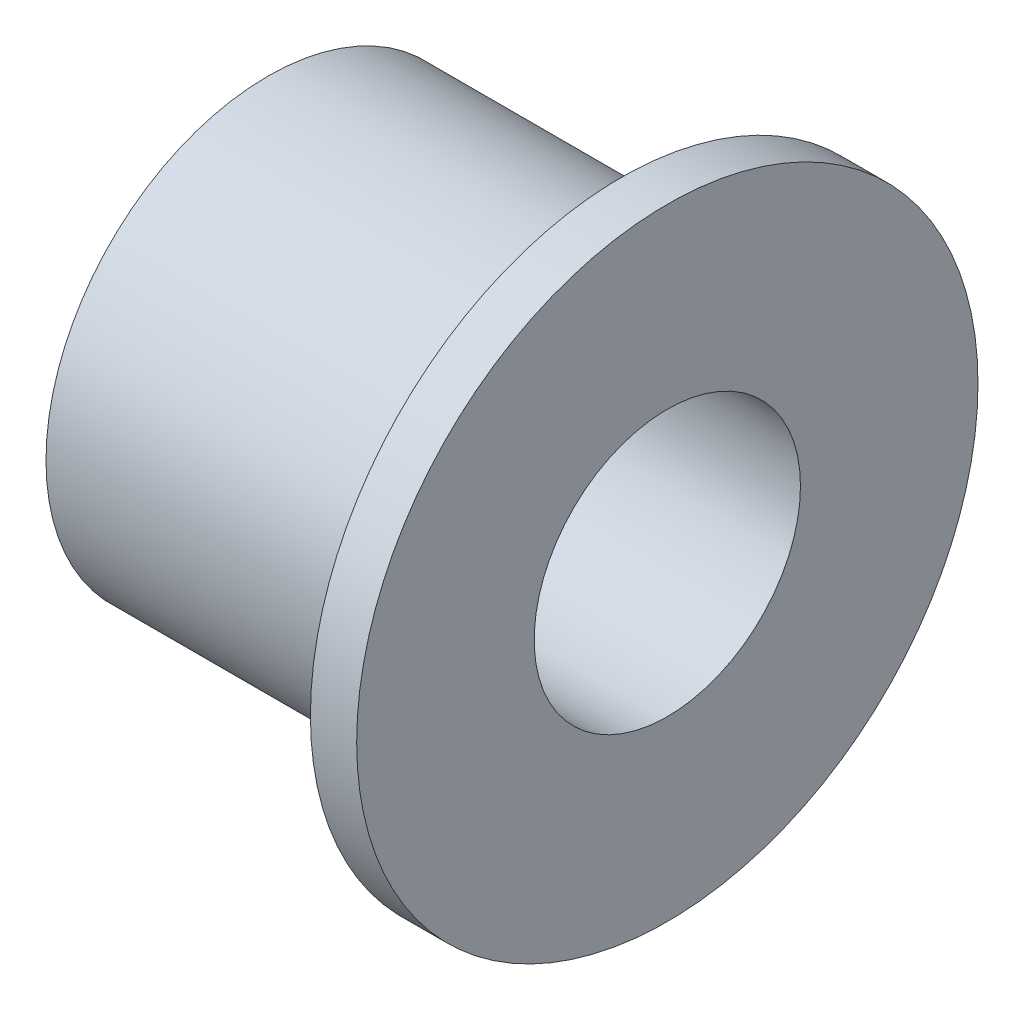
ISO-10303-21;
HEADER;
FILE_DESCRIPTION(('STEP AP214'),'2;1');
FILE_NAME('part.step','',(''),(''),'','','');
FILE_SCHEMA(('AUTOMOTIVE_DESIGN { 1 0 10303 214 1 1 1 1 }'));
ENDSEC;
DATA;
#1=APPLICATION_CONTEXT('core data for automotive mechanical design processes');
#2=APPLICATION_PROTOCOL_DEFINITION('international standard','automotive_design',2000,#1);
#3=PRODUCT_CONTEXT('',#1,'mechanical');
#4=PRODUCT('Part','Part','',(#3));
#5=PRODUCT_RELATED_PRODUCT_CATEGORY('part','',(#4));
#6=PRODUCT_DEFINITION_FORMATION('','',#4);
#7=PRODUCT_DEFINITION_CONTEXT('part definition',#1,'design');
#8=PRODUCT_DEFINITION('design','',#6,#7);
#9=PRODUCT_DEFINITION_SHAPE('','',#8);
#10=(LENGTH_UNIT() NAMED_UNIT(*) SI_UNIT(.MILLI.,.METRE.));
#11=(NAMED_UNIT(*) PLANE_ANGLE_UNIT() SI_UNIT($,.RADIAN.));
#12=(NAMED_UNIT(*) SI_UNIT($,.STERADIAN.) SOLID_ANGLE_UNIT());
#13=UNCERTAINTY_MEASURE_WITH_UNIT(LENGTH_MEASURE(1.E-05),#10,'distance_accuracy_value','');
#14=(GEOMETRIC_REPRESENTATION_CONTEXT(3) GLOBAL_UNCERTAINTY_ASSIGNED_CONTEXT((#13)) GLOBAL_UNIT_ASSIGNED_CONTEXT((#10,
#11,#12)) REPRESENTATION_CONTEXT('',''));
#15=CARTESIAN_POINT('',(0.,0.,0.));
#16=DIRECTION('',(0.,0.,1.));
#17=DIRECTION('',(1.,0.,0.));
#18=AXIS2_PLACEMENT_3D('',#15,#16,#17);
#19=CARTESIAN_POINT('',(12.7,0.,0.));
#20=DIRECTION('',(-1.,0.,0.));
#21=DIRECTION('',(0.,0.,1.));
#22=AXIS2_PLACEMENT_3D('',#19,#20,#21);
#23=CYLINDRICAL_SURFACE('',#22,7.9375);
#24=CARTESIAN_POINT('',(0.,0.,0.));
#25=DIRECTION('',(1.,0.,0.));
#26=DIRECTION('',(0.,0.,-1.));
#27=AXIS2_PLACEMENT_3D('',#24,#25,#26);
#28=CIRCLE('',#27,7.9375);
#29=CARTESIAN_POINT('',(0.,0.,-7.9375));
#30=VERTEX_POINT('',#29);
#31=EDGE_CURVE('E34',#30,#30,#28,.T.);
#32=ORIENTED_EDGE('',*,*,#31,.T.);
#33=EDGE_LOOP('',(#32));
#34=FACE_BOUND('',#33,.T.);
#35=CARTESIAN_POINT('',(12.6327746792743,0.,0.));
#36=DIRECTION('',(1.,0.,0.));
#37=DIRECTION('',(0.,0.,-1.));
#38=AXIS2_PLACEMENT_3D('',#35,#36,#37);
#39=CIRCLE('',#38,7.9375);
#40=CARTESIAN_POINT('',(12.6327746792743,0.,-7.9375));
#41=VERTEX_POINT('',#40);
#42=EDGE_CURVE('E10',#41,#41,#39,.T.);
#43=ORIENTED_EDGE('',*,*,#42,.F.);
#44=EDGE_LOOP('',(#43));
#45=FACE_BOUND('',#44,.T.);
#46=ADVANCED_FACE('F31',(#34,#45),#23,.T.);
#47=CARTESIAN_POINT('',(0.,0.,0.));
#48=DIRECTION('',(1.,0.,0.));
#49=DIRECTION('',(0.,0.,-1.));
#50=AXIS2_PLACEMENT_3D('',#47,#48,#49);
#51=PLANE('',#50);
#52=ORIENTED_EDGE('',*,*,#31,.F.);
#53=EDGE_LOOP('',(#52));
#54=FACE_BOUND('',#53,.T.);
#55=CARTESIAN_POINT('',(0.,0.,0.));
#56=DIRECTION('',(1.,0.,0.));
#57=DIRECTION('',(0.,0.,-1.));
#58=AXIS2_PLACEMENT_3D('',#55,#56,#57);
#59=CIRCLE('',#58,4.7625);
#60=CARTESIAN_POINT('',(0.,0.,-4.7625));
#61=VERTEX_POINT('',#60);
#62=EDGE_CURVE('E42',#61,#61,#59,.T.);
#63=ORIENTED_EDGE('',*,*,#62,.T.);
#64=EDGE_LOOP('',(#63));
#65=FACE_BOUND('',#64,.T.);
#66=ADVANCED_FACE('F74',(#54,#65),#51,.F.);
#67=CARTESIAN_POINT('',(12.7,0.,0.));
#68=DIRECTION('',(-1.,0.,0.));
#69=DIRECTION('',(0.,0.,1.));
#70=AXIS2_PLACEMENT_3D('',#67,#68,#69);
#71=CYLINDRICAL_SURFACE('',#70,4.7625);
#72=ORIENTED_EDGE('',*,*,#62,.F.);
#73=EDGE_LOOP('',(#72));
#74=FACE_BOUND('',#73,.T.);
#75=CARTESIAN_POINT('',(14.2875,0.,0.));
#76=DIRECTION('',(1.,0.,0.));
#77=DIRECTION('',(0.,0.,-1.));
#78=AXIS2_PLACEMENT_3D('',#75,#76,#77);
#79=CIRCLE('',#78,4.7625);
#80=CARTESIAN_POINT('',(14.2875,0.,-4.7625));
#81=VERTEX_POINT('',#80);
#82=EDGE_CURVE('E54',#81,#81,#79,.T.);
#83=ORIENTED_EDGE('',*,*,#82,.T.);
#84=EDGE_LOOP('',(#83));
#85=FACE_BOUND('',#84,.T.);
#86=ADVANCED_FACE('F61',(#74,#85),#71,.F.);
#87=CARTESIAN_POINT('',(12.6327746792743,0.,0.));
#88=DIRECTION('',(1.,0.,0.));
#89=DIRECTION('',(0.,0.,-1.));
#90=AXIS2_PLACEMENT_3D('',#87,#88,#89);
#91=PLANE('',#90);
#92=CARTESIAN_POINT('',(12.6327746792743,0.,0.));
#93=DIRECTION('',(1.,0.,0.));
#94=DIRECTION('',(0.,0.,-1.));
#95=AXIS2_PLACEMENT_3D('',#92,#93,#94);
#96=CIRCLE('',#95,11.1125);
#97=CARTESIAN_POINT('',(12.6327746792743,0.,-11.1125));
#98=VERTEX_POINT('',#97);
#99=EDGE_CURVE('E44',#98,#98,#96,.T.);
#100=ORIENTED_EDGE('',*,*,#99,.F.);
#101=EDGE_LOOP('',(#100));
#102=FACE_BOUND('',#101,.T.);
#103=ORIENTED_EDGE('',*,*,#42,.T.);
#104=EDGE_LOOP('',(#103));
#105=FACE_BOUND('',#104,.T.);
#106=ADVANCED_FACE('F70',(#102,#105),#91,.F.);
#107=CARTESIAN_POINT('',(12.6327746792743,0.,0.));
#108=DIRECTION('',(1.,0.,0.));
#109=DIRECTION('',(0.,0.,-1.));
#110=AXIS2_PLACEMENT_3D('',#107,#108,#109);
#111=CYLINDRICAL_SURFACE('',#110,11.1125);
#112=ORIENTED_EDGE('',*,*,#99,.T.);
#113=EDGE_LOOP('',(#112));
#114=FACE_BOUND('',#113,.T.);
#115=CARTESIAN_POINT('',(14.2875,0.,0.));
#116=DIRECTION('',(1.,0.,0.));
#117=DIRECTION('',(0.,0.,-1.));
#118=AXIS2_PLACEMENT_3D('',#115,#116,#117);
#119=CIRCLE('',#118,11.1125);
#120=CARTESIAN_POINT('',(14.2875,0.,-11.1125));
#121=VERTEX_POINT('',#120);
#122=EDGE_CURVE('E50',#121,#121,#119,.T.);
#123=ORIENTED_EDGE('',*,*,#122,.F.);
#124=EDGE_LOOP('',(#123));
#125=FACE_BOUND('',#124,.T.);
#126=ADVANCED_FACE('F65',(#114,#125),#111,.T.);
#127=CARTESIAN_POINT('',(14.2875,0.,0.));
#128=DIRECTION('',(1.,0.,0.));
#129=DIRECTION('',(0.,0.,-1.));
#130=AXIS2_PLACEMENT_3D('',#127,#128,#129);
#131=PLANE('',#130);
#132=ORIENTED_EDGE('',*,*,#122,.T.);
#133=EDGE_LOOP('',(#132));
#134=FACE_BOUND('',#133,.T.);
#135=ORIENTED_EDGE('',*,*,#82,.F.);
#136=EDGE_LOOP('',(#135));
#137=FACE_BOUND('',#136,.T.);
#138=ADVANCED_FACE('F63',(#134,#137),#131,.T.);
#139=CLOSED_SHELL('',(#46,#66,#86,#106,#126,#138));
#140=MANIFOLD_SOLID_BREP('B2',#139);
#141=ADVANCED_BREP_SHAPE_REPRESENTATION('',(#18,#140),#14);
#142=SHAPE_DEFINITION_REPRESENTATION(#9,#141);
ENDSEC;
END-ISO-10303-21;
